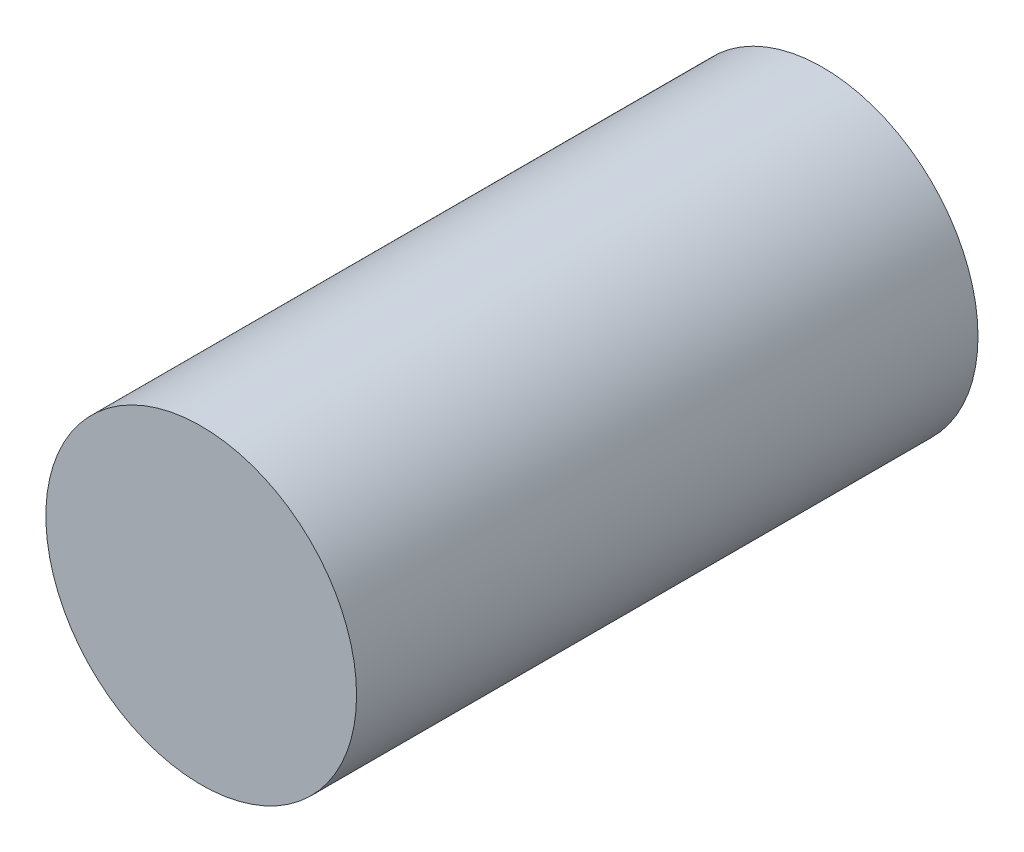
ISO-10303-21;
HEADER;
FILE_DESCRIPTION(('STEP AP214'),'2;1');
FILE_NAME('part.step','',(''),(''),'','','');
FILE_SCHEMA(('AUTOMOTIVE_DESIGN { 1 0 10303 214 1 1 1 1 }'));
ENDSEC;
DATA;
#1=APPLICATION_CONTEXT('core data for automotive mechanical design processes');
#2=APPLICATION_PROTOCOL_DEFINITION('international standard','automotive_design',2000,#1);
#3=PRODUCT_CONTEXT('',#1,'mechanical');
#4=PRODUCT('Part','Part','',(#3));
#5=PRODUCT_RELATED_PRODUCT_CATEGORY('part','',(#4));
#6=PRODUCT_DEFINITION_FORMATION('','',#4);
#7=PRODUCT_DEFINITION_CONTEXT('part definition',#1,'design');
#8=PRODUCT_DEFINITION('design','',#6,#7);
#9=PRODUCT_DEFINITION_SHAPE('','',#8);
#10=(LENGTH_UNIT() NAMED_UNIT(*) SI_UNIT(.MILLI.,.METRE.));
#11=(NAMED_UNIT(*) PLANE_ANGLE_UNIT() SI_UNIT($,.RADIAN.));
#12=(NAMED_UNIT(*) SI_UNIT($,.STERADIAN.) SOLID_ANGLE_UNIT());
#13=UNCERTAINTY_MEASURE_WITH_UNIT(LENGTH_MEASURE(1.E-05),#10,'distance_accuracy_value','');
#14=(GEOMETRIC_REPRESENTATION_CONTEXT(3) GLOBAL_UNCERTAINTY_ASSIGNED_CONTEXT((#13)) GLOBAL_UNIT_ASSIGNED_CONTEXT((#10,
#11,#12)) REPRESENTATION_CONTEXT('',''));
#15=CARTESIAN_POINT('',(0.,0.,0.));
#16=DIRECTION('',(0.,0.,1.));
#17=DIRECTION('',(1.,0.,0.));
#18=AXIS2_PLACEMENT_3D('',#15,#16,#17);
#19=CARTESIAN_POINT('',(0.,0.,5.));
#20=DIRECTION('',(0.,0.,-1.));
#21=DIRECTION('',(-1.,0.,0.));
#22=AXIS2_PLACEMENT_3D('',#19,#20,#21);
#23=CYLINDRICAL_SURFACE('',#22,1.25);
#24=CARTESIAN_POINT('',(0.,0.,5.));
#25=DIRECTION('',(0.,0.,1.));
#26=DIRECTION('',(1.,0.,0.));
#27=AXIS2_PLACEMENT_3D('',#24,#25,#26);
#28=CIRCLE('',#27,1.25);
#29=CARTESIAN_POINT('',(1.25,0.,5.));
#30=VERTEX_POINT('',#29);
#31=EDGE_CURVE('E10',#30,#30,#28,.T.);
#32=ORIENTED_EDGE('',*,*,#31,.F.);
#33=EDGE_LOOP('',(#32));
#34=FACE_BOUND('',#33,.T.);
#35=CARTESIAN_POINT('',(0.,0.,0.));
#36=DIRECTION('',(0.,0.,1.));
#37=DIRECTION('',(1.,0.,0.));
#38=AXIS2_PLACEMENT_3D('',#35,#36,#37);
#39=CIRCLE('',#38,1.25);
#40=CARTESIAN_POINT('',(1.25,0.,0.));
#41=VERTEX_POINT('',#40);
#42=EDGE_CURVE('E44',#41,#41,#39,.T.);
#43=ORIENTED_EDGE('',*,*,#42,.T.);
#44=EDGE_LOOP('',(#43));
#45=FACE_BOUND('',#44,.T.);
#46=ADVANCED_FACE('F41',(#34,#45),#23,.T.);
#47=CARTESIAN_POINT('',(0.,0.,5.));
#48=DIRECTION('',(0.,0.,1.));
#49=DIRECTION('',(1.,0.,0.));
#50=AXIS2_PLACEMENT_3D('',#47,#48,#49);
#51=PLANE('',#50);
#52=ORIENTED_EDGE('',*,*,#31,.T.);
#53=EDGE_LOOP('',(#52));
#54=FACE_BOUND('',#53,.T.);
#55=ADVANCED_FACE('F58',(#54),#51,.T.);
#56=CARTESIAN_POINT('',(0.,0.,0.));
#57=DIRECTION('',(0.,0.,1.));
#58=DIRECTION('',(1.,0.,0.));
#59=AXIS2_PLACEMENT_3D('',#56,#57,#58);
#60=PLANE('',#59);
#61=ORIENTED_EDGE('',*,*,#42,.F.);
#62=EDGE_LOOP('',(#61));
#63=FACE_BOUND('',#62,.T.);
#64=ADVANCED_FACE('F56',(#63),#60,.F.);
#65=CLOSED_SHELL('',(#46,#55,#64));
#66=MANIFOLD_SOLID_BREP('B2',#65);
#67=ADVANCED_BREP_SHAPE_REPRESENTATION('',(#18,#66),#14);
#68=SHAPE_DEFINITION_REPRESENTATION(#9,#67);
ENDSEC;
END-ISO-10303-21;
